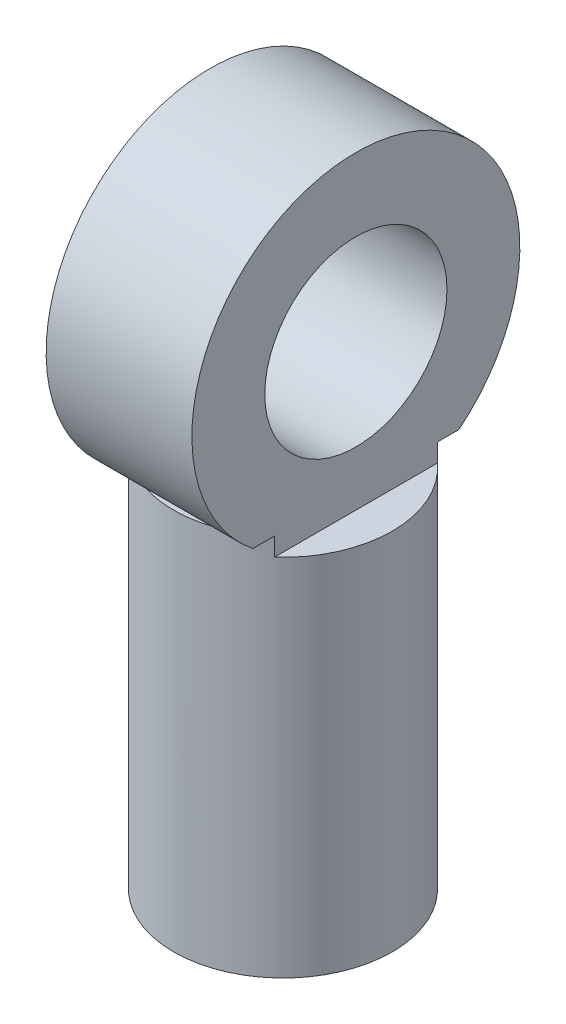
ISO-10303-21;
HEADER;
FILE_DESCRIPTION(('STEP AP214'),'2;1');
FILE_NAME('part.step','',(''),(''),'','','');
FILE_SCHEMA(('AUTOMOTIVE_DESIGN { 1 0 10303 214 1 1 1 1 }'));
ENDSEC;
DATA;
#1=APPLICATION_CONTEXT('core data for automotive mechanical design processes');
#2=APPLICATION_PROTOCOL_DEFINITION('international standard','automotive_design',2000,#1);
#3=PRODUCT_CONTEXT('',#1,'mechanical');
#4=PRODUCT('Part','Part','',(#3));
#5=PRODUCT_RELATED_PRODUCT_CATEGORY('part','',(#4));
#6=PRODUCT_DEFINITION_FORMATION('','',#4);
#7=PRODUCT_DEFINITION_CONTEXT('part definition',#1,'design');
#8=PRODUCT_DEFINITION('design','',#6,#7);
#9=PRODUCT_DEFINITION_SHAPE('','',#8);
#10=(LENGTH_UNIT() NAMED_UNIT(*) SI_UNIT(.MILLI.,.METRE.));
#11=(NAMED_UNIT(*) PLANE_ANGLE_UNIT() SI_UNIT($,.RADIAN.));
#12=(NAMED_UNIT(*) SI_UNIT($,.STERADIAN.) SOLID_ANGLE_UNIT());
#13=UNCERTAINTY_MEASURE_WITH_UNIT(LENGTH_MEASURE(1.E-05),#10,'distance_accuracy_value','');
#14=(GEOMETRIC_REPRESENTATION_CONTEXT(3) GLOBAL_UNCERTAINTY_ASSIGNED_CONTEXT((#13)) GLOBAL_UNIT_ASSIGNED_CONTEXT((#10,
#11,#12)) REPRESENTATION_CONTEXT('',''));
#15=CARTESIAN_POINT('',(0.,0.,0.));
#16=DIRECTION('',(0.,0.,1.));
#17=DIRECTION('',(1.,0.,0.));
#18=AXIS2_PLACEMENT_3D('',#15,#16,#17);
#19=CARTESIAN_POINT('',(-2.,10.5,0.));
#20=DIRECTION('',(0.,-1.,0.));
#21=DIRECTION('',(0.,0.,-1.));
#22=AXIS2_PLACEMENT_3D('',#19,#20,#21);
#23=PLANE('',#22);
#24=DIRECTION('',(1.,0.,0.));
#25=VECTOR('',#24,1.);
#26=CARTESIAN_POINT('',(-2.,10.5,2.82842712474619));
#27=LINE('',#26,#25);
#28=CARTESIAN_POINT('',(-0.999999999999999,10.5,2.82842712474619));
#29=VERTEX_POINT('',#28);
#30=CARTESIAN_POINT('',(0.999999999999999,10.5,2.82842712474619));
#31=VERTEX_POINT('',#30);
#32=EDGE_CURVE('E186',#29,#31,#27,.T.);
#33=ORIENTED_EDGE('',*,*,#32,.F.);
#34=CARTESIAN_POINT('',(0.,10.5,0.));
#35=DIRECTION('',(0.,1.,0.));
#36=DIRECTION('',(0.,0.,1.));
#37=AXIS2_PLACEMENT_3D('',#34,#35,#36);
#38=CIRCLE('',#37,3.);
#39=EDGE_CURVE('E180',#29,#31,#38,.T.);
#40=ORIENTED_EDGE('',*,*,#39,.T.);
#41=EDGE_LOOP('',(#33,#40));
#42=FACE_BOUND('',#41,.T.);
#43=ADVANCED_FACE('F94',(#42),#23,.F.);
#44=CARTESIAN_POINT('',(2.,10.5,0.));
#45=DIRECTION('',(0.,1.,0.));
#46=DIRECTION('',(0.,0.,1.));
#47=AXIS2_PLACEMENT_3D('',#44,#45,#46);
#48=PLANE('',#47);
#49=CARTESIAN_POINT('',(0.999999999999992,10.5,-2.82842712474619));
#50=VERTEX_POINT('',#49);
#51=CARTESIAN_POINT('',(-0.999999999999992,10.5,-2.82842712474619));
#52=VERTEX_POINT('',#51);
#53=EDGE_CURVE('E459',#50,#52,#38,.T.);
#54=ORIENTED_EDGE('',*,*,#53,.T.);
#55=DIRECTION('',(1.,0.,0.));
#56=VECTOR('',#55,1.);
#57=CARTESIAN_POINT('',(-2.,10.5,-2.82842712474619));
#58=LINE('',#57,#56);
#59=EDGE_CURVE('E423',#52,#50,#58,.T.);
#60=ORIENTED_EDGE('',*,*,#59,.T.);
#61=EDGE_LOOP('',(#54,#60));
#62=FACE_BOUND('',#61,.T.);
#63=ADVANCED_FACE('F240',(#62),#48,.T.);
#64=CARTESIAN_POINT('',(0.,10.,0.));
#65=DIRECTION('',(0.,1.,0.));
#66=DIRECTION('',(0.,0.,1.));
#67=AXIS2_PLACEMENT_3D('',#64,#65,#66);
#68=PLANE('',#67);
#69=CARTESIAN_POINT('',(0.,10.,0.));
#70=DIRECTION('',(0.,1.,0.));
#71=DIRECTION('',(0.,0.,1.));
#72=AXIS2_PLACEMENT_3D('',#69,#70,#71);
#73=CIRCLE('',#72,3.);
#74=CARTESIAN_POINT('',(-2.,10.,-2.23606797749979));
#75=VERTEX_POINT('',#74);
#76=CARTESIAN_POINT('',(-2.,10.,2.23606797749979));
#77=VERTEX_POINT('',#76);
#78=EDGE_CURVE('E210',#75,#77,#73,.T.);
#79=ORIENTED_EDGE('',*,*,#78,.T.);
#80=DIRECTION('',(0.,0.,-1.));
#81=VECTOR('',#80,1.);
#82=CARTESIAN_POINT('',(-2.,10.,0.));
#83=LINE('',#82,#81);
#84=EDGE_CURVE('E13',#77,#75,#83,.T.);
#85=ORIENTED_EDGE('',*,*,#84,.T.);
#86=EDGE_LOOP('',(#79,#85));
#87=FACE_BOUND('',#86,.T.);
#88=ADVANCED_FACE('F237',(#87),#68,.T.);
#89=CARTESIAN_POINT('',(0.,10.,0.));
#90=DIRECTION('',(0.,-1.,0.));
#91=DIRECTION('',(0.,0.,-1.));
#92=AXIS2_PLACEMENT_3D('',#89,#90,#91);
#93=CYLINDRICAL_SURFACE('',#92,3.);
#94=CARTESIAN_POINT('',(2.,10.,2.23606797749979));
#95=VERTEX_POINT('',#94);
#96=CARTESIAN_POINT('',(2.,10.,-2.23606797749979));
#97=VERTEX_POINT('',#96);
#98=EDGE_CURVE('E213',#95,#97,#73,.T.);
#99=ORIENTED_EDGE('',*,*,#98,.F.);
#100=DIRECTION('',(0.,-1.,0.));
#101=VECTOR('',#100,1.);
#102=CARTESIAN_POINT('',(2.,10.5,2.23606797749979));
#103=LINE('',#102,#101);
#104=CARTESIAN_POINT('',(2.,10.5,2.23606797749979));
#105=VERTEX_POINT('',#104);
#106=EDGE_CURVE('E120',#95,#105,#103,.F.);
#107=ORIENTED_EDGE('',*,*,#106,.T.);
#108=EDGE_CURVE('E166',#31,#105,#38,.T.);
#109=ORIENTED_EDGE('',*,*,#108,.F.);
#110=ORIENTED_EDGE('',*,*,#39,.F.);
#111=CARTESIAN_POINT('',(-2.,10.5,2.23606797749979));
#112=VERTEX_POINT('',#111);
#113=EDGE_CURVE('E190',#112,#29,#38,.T.);
#114=ORIENTED_EDGE('',*,*,#113,.F.);
#115=DIRECTION('',(0.,-1.,0.));
#116=VECTOR('',#115,1.);
#117=CARTESIAN_POINT('',(-2.,10.5,2.23606797749979));
#118=LINE('',#117,#116);
#119=EDGE_CURVE('E189',#77,#112,#118,.F.);
#120=ORIENTED_EDGE('',*,*,#119,.F.);
#121=ORIENTED_EDGE('',*,*,#78,.F.);
#122=DIRECTION('',(0.,-1.,0.));
#123=VECTOR('',#122,1.);
#124=CARTESIAN_POINT('',(-2.,10.5,-2.23606797749979));
#125=LINE('',#124,#123);
#126=CARTESIAN_POINT('',(-2.,10.5,-2.23606797749979));
#127=VERTEX_POINT('',#126);
#128=EDGE_CURVE('E444',#127,#75,#125,.T.);
#129=ORIENTED_EDGE('',*,*,#128,.F.);
#130=EDGE_CURVE('E462',#52,#127,#38,.T.);
#131=ORIENTED_EDGE('',*,*,#130,.F.);
#132=ORIENTED_EDGE('',*,*,#53,.F.);
#133=CARTESIAN_POINT('',(2.,10.5,-2.23606797749979));
#134=VERTEX_POINT('',#133);
#135=EDGE_CURVE('E112',#134,#50,#38,.T.);
#136=ORIENTED_EDGE('',*,*,#135,.F.);
#137=DIRECTION('',(0.,-1.,0.));
#138=VECTOR('',#137,1.);
#139=CARTESIAN_POINT('',(2.,10.5,-2.23606797749979));
#140=LINE('',#139,#138);
#141=EDGE_CURVE('E453',#134,#97,#140,.T.);
#142=ORIENTED_EDGE('',*,*,#141,.T.);
#143=EDGE_LOOP('',(#99,#107,#109,#110,#114,#120,#121,#129,#131,#132,#136,#142));
#144=FACE_BOUND('',#143,.T.);
#145=CARTESIAN_POINT('',(0.,0.,0.));
#146=DIRECTION('',(0.,1.,0.));
#147=DIRECTION('',(0.,0.,1.));
#148=AXIS2_PLACEMENT_3D('',#145,#146,#147);
#149=CIRCLE('',#148,3.);
#150=CARTESIAN_POINT('',(0.,0.,3.));
#151=VERTEX_POINT('',#150);
#152=EDGE_CURVE('E98',#151,#151,#149,.T.);
#153=ORIENTED_EDGE('',*,*,#152,.T.);
#154=EDGE_LOOP('',(#153));
#155=FACE_BOUND('',#154,.T.);
#156=ADVANCED_FACE('F96',(#144,#155),#93,.T.);
#157=DIRECTION('',(0.,0.,-1.));
#158=VECTOR('',#157,1.);
#159=CARTESIAN_POINT('',(2.,10.,0.));
#160=LINE('',#159,#158);
#161=EDGE_CURVE('E104',#95,#97,#160,.T.);
#162=ORIENTED_EDGE('',*,*,#161,.F.);
#163=ORIENTED_EDGE('',*,*,#98,.T.);
#164=EDGE_LOOP('',(#162,#163));
#165=FACE_BOUND('',#164,.T.);
#166=ADVANCED_FACE('F226',(#165),#68,.T.);
#167=CARTESIAN_POINT('',(0.,0.,0.));
#168=DIRECTION('',(0.,1.,0.));
#169=DIRECTION('',(0.,0.,1.));
#170=AXIS2_PLACEMENT_3D('',#167,#168,#169);
#171=PLANE('',#170);
#172=CARTESIAN_POINT('',(0.,0.,0.));
#173=DIRECTION('',(0.,-1.,0.));
#174=DIRECTION('',(0.,0.,-1.));
#175=AXIS2_PLACEMENT_3D('',#172,#173,#174);
#176=CIRCLE('',#175,1.65);
#177=CARTESIAN_POINT('',(0.,0.,-1.65));
#178=VERTEX_POINT('',#177);
#179=EDGE_CURVE('E200',#178,#178,#176,.T.);
#180=ORIENTED_EDGE('',*,*,#179,.F.);
#181=EDGE_LOOP('',(#180));
#182=FACE_BOUND('',#181,.T.);
#183=ORIENTED_EDGE('',*,*,#152,.F.);
#184=EDGE_LOOP('',(#183));
#185=FACE_BOUND('',#184,.T.);
#186=ADVANCED_FACE('F223',(#182,#185),#171,.F.);
#187=CARTESIAN_POINT('',(0.,9.,0.));
#188=DIRECTION('',(0.,-1.,0.));
#189=DIRECTION('',(0.,0.,-1.));
#190=AXIS2_PLACEMENT_3D('',#187,#188,#189);
#191=CYLINDRICAL_SURFACE('',#190,1.65);
#192=CARTESIAN_POINT('',(0.,9.,0.));
#193=DIRECTION('',(0.,-1.,0.));
#194=DIRECTION('',(0.,0.,-1.));
#195=AXIS2_PLACEMENT_3D('',#192,#193,#194);
#196=CIRCLE('',#195,1.65);
#197=CARTESIAN_POINT('',(0.,9.,-1.65));
#198=VERTEX_POINT('',#197);
#199=EDGE_CURVE('E204',#198,#198,#196,.T.);
#200=ORIENTED_EDGE('',*,*,#199,.F.);
#201=EDGE_LOOP('',(#200));
#202=FACE_BOUND('',#201,.T.);
#203=ORIENTED_EDGE('',*,*,#179,.T.);
#204=EDGE_LOOP('',(#203));
#205=FACE_BOUND('',#204,.T.);
#206=ADVANCED_FACE('F225',(#202,#205),#191,.F.);
#207=CARTESIAN_POINT('',(0.,9.,0.));
#208=DIRECTION('',(0.,-1.,0.));
#209=DIRECTION('',(0.,0.,-1.));
#210=AXIS2_PLACEMENT_3D('',#207,#208,#209);
#211=PLANE('',#210);
#212=ORIENTED_EDGE('',*,*,#199,.T.);
#213=EDGE_LOOP('',(#212));
#214=FACE_BOUND('',#213,.T.);
#215=ADVANCED_FACE('F232',(#214),#211,.T.);
#216=CARTESIAN_POINT('',(-2.,14.,0.));
#217=DIRECTION('',(1.,0.,0.));
#218=DIRECTION('',(0.,0.,-1.));
#219=AXIS2_PLACEMENT_3D('',#216,#217,#218);
#220=CYLINDRICAL_SURFACE('',#219,4.5);
#221=CARTESIAN_POINT('',(-2.,10.5,-2.82842712474619));
#222=VERTEX_POINT('',#221);
#223=EDGE_CURVE('E201',#222,#52,#58,.T.);
#224=ORIENTED_EDGE('',*,*,#223,.F.);
#225=CARTESIAN_POINT('',(-2.,14.,0.));
#226=DIRECTION('',(1.,0.,0.));
#227=DIRECTION('',(0.,0.,-1.));
#228=AXIS2_PLACEMENT_3D('',#225,#226,#227);
#229=CIRCLE('',#228,4.5);
#230=CARTESIAN_POINT('',(-2.,10.5,2.82842712474619));
#231=VERTEX_POINT('',#230);
#232=EDGE_CURVE('E196',#222,#231,#229,.T.);
#233=ORIENTED_EDGE('',*,*,#232,.T.);
#234=EDGE_CURVE('E194',#231,#29,#27,.T.);
#235=ORIENTED_EDGE('',*,*,#234,.T.);
#236=ORIENTED_EDGE('',*,*,#32,.T.);
#237=DIRECTION('',(1.,0.,0.));
#238=VECTOR('',#237,1.);
#239=CARTESIAN_POINT('',(-2.,10.5,2.82842712474619));
#240=LINE('',#239,#238);
#241=CARTESIAN_POINT('',(2.,10.5,2.82842712474619));
#242=VERTEX_POINT('',#241);
#243=EDGE_CURVE('E163',#242,#31,#240,.F.);
#244=ORIENTED_EDGE('',*,*,#243,.F.);
#245=CARTESIAN_POINT('',(2.,14.,0.));
#246=DIRECTION('',(1.,0.,0.));
#247=DIRECTION('',(0.,0.,-1.));
#248=AXIS2_PLACEMENT_3D('',#245,#246,#247);
#249=CIRCLE('',#248,4.5);
#250=CARTESIAN_POINT('',(2.,10.5,-2.82842712474619));
#251=VERTEX_POINT('',#250);
#252=EDGE_CURVE('E429',#251,#242,#249,.T.);
#253=ORIENTED_EDGE('',*,*,#252,.F.);
#254=DIRECTION('',(1.,0.,0.));
#255=VECTOR('',#254,1.);
#256=CARTESIAN_POINT('',(-2.,10.5,-2.82842712474619));
#257=LINE('',#256,#255);
#258=EDGE_CURVE('E442',#50,#251,#257,.T.);
#259=ORIENTED_EDGE('',*,*,#258,.F.);
#260=ORIENTED_EDGE('',*,*,#59,.F.);
#261=EDGE_LOOP('',(#224,#233,#235,#236,#244,#253,#259,#260));
#262=FACE_BOUND('',#261,.T.);
#263=ADVANCED_FACE('F192',(#262),#220,.T.);
#264=CARTESIAN_POINT('',(-2.,0.,0.));
#265=DIRECTION('',(1.,0.,0.));
#266=DIRECTION('',(0.,0.,-1.));
#267=AXIS2_PLACEMENT_3D('',#264,#265,#266);
#268=PLANE('',#267);
#269=CARTESIAN_POINT('',(-2.,14.,0.));
#270=DIRECTION('',(1.,0.,0.));
#271=DIRECTION('',(0.,0.,-1.));
#272=AXIS2_PLACEMENT_3D('',#269,#270,#271);
#273=CIRCLE('',#272,2.5);
#274=CARTESIAN_POINT('',(-2.,14.,-2.5));
#275=VERTEX_POINT('',#274);
#276=EDGE_CURVE('E433',#275,#275,#273,.T.);
#277=ORIENTED_EDGE('',*,*,#276,.T.);
#278=EDGE_LOOP('',(#277));
#279=FACE_BOUND('',#278,.T.);
#280=ORIENTED_EDGE('',*,*,#119,.T.);
#281=DIRECTION('',(0.,0.,1.));
#282=VECTOR('',#281,1.);
#283=CARTESIAN_POINT('',(-2.,10.5,0.));
#284=LINE('',#283,#282);
#285=EDGE_CURVE('E412',#112,#231,#284,.T.);
#286=ORIENTED_EDGE('',*,*,#285,.T.);
#287=ORIENTED_EDGE('',*,*,#232,.F.);
#288=EDGE_CURVE('E174',#222,#127,#284,.T.);
#289=ORIENTED_EDGE('',*,*,#288,.T.);
#290=ORIENTED_EDGE('',*,*,#128,.T.);
#291=ORIENTED_EDGE('',*,*,#84,.F.);
#292=EDGE_LOOP('',(#280,#286,#287,#289,#290,#291));
#293=FACE_BOUND('',#292,.T.);
#294=ADVANCED_FACE('F249',(#279,#293),#268,.F.);
#295=CARTESIAN_POINT('',(2.,0.,0.));
#296=DIRECTION('',(1.,0.,0.));
#297=DIRECTION('',(0.,0.,-1.));
#298=AXIS2_PLACEMENT_3D('',#295,#296,#297);
#299=PLANE('',#298);
#300=DIRECTION('',(0.,0.,1.));
#301=VECTOR('',#300,1.);
#302=CARTESIAN_POINT('',(2.,10.5,0.));
#303=LINE('',#302,#301);
#304=EDGE_CURVE('E167',#105,#242,#303,.T.);
#305=ORIENTED_EDGE('',*,*,#304,.F.);
#306=ORIENTED_EDGE('',*,*,#106,.F.);
#307=ORIENTED_EDGE('',*,*,#161,.T.);
#308=ORIENTED_EDGE('',*,*,#141,.F.);
#309=EDGE_CURVE('E418',#251,#134,#303,.T.);
#310=ORIENTED_EDGE('',*,*,#309,.F.);
#311=ORIENTED_EDGE('',*,*,#252,.T.);
#312=EDGE_LOOP('',(#305,#306,#307,#308,#310,#311));
#313=FACE_BOUND('',#312,.T.);
#314=CARTESIAN_POINT('',(2.,14.,0.));
#315=DIRECTION('',(1.,0.,0.));
#316=DIRECTION('',(0.,0.,-1.));
#317=AXIS2_PLACEMENT_3D('',#314,#315,#316);
#318=CIRCLE('',#317,2.5);
#319=CARTESIAN_POINT('',(2.,14.,-2.5));
#320=VERTEX_POINT('',#319);
#321=EDGE_CURVE('E173',#320,#320,#318,.T.);
#322=ORIENTED_EDGE('',*,*,#321,.F.);
#323=EDGE_LOOP('',(#322));
#324=FACE_BOUND('',#323,.T.);
#325=ADVANCED_FACE('F272',(#313,#324),#299,.T.);
#326=CARTESIAN_POINT('',(-3.,14.,0.));
#327=DIRECTION('',(1.,0.,0.));
#328=DIRECTION('',(0.,0.,-1.));
#329=AXIS2_PLACEMENT_3D('',#326,#327,#328);
#330=CYLINDRICAL_SURFACE('',#329,2.5);
#331=ORIENTED_EDGE('',*,*,#321,.T.);
#332=EDGE_LOOP('',(#331));
#333=FACE_BOUND('',#332,.T.);
#334=ORIENTED_EDGE('',*,*,#276,.F.);
#335=EDGE_LOOP('',(#334));
#336=FACE_BOUND('',#335,.T.);
#337=ADVANCED_FACE('F279',(#333,#336),#330,.F.);
#338=CARTESIAN_POINT('',(0.,10.5,0.));
#339=DIRECTION('',(0.,1.,0.));
#340=DIRECTION('',(0.,0.,1.));
#341=AXIS2_PLACEMENT_3D('',#338,#339,#340);
#342=PLANE('',#341);
#343=ORIENTED_EDGE('',*,*,#309,.T.);
#344=ORIENTED_EDGE('',*,*,#135,.T.);
#345=ORIENTED_EDGE('',*,*,#258,.T.);
#346=EDGE_LOOP('',(#343,#344,#345));
#347=FACE_BOUND('',#346,.T.);
#348=ADVANCED_FACE('F286',(#347),#342,.F.);
#349=ORIENTED_EDGE('',*,*,#223,.T.);
#350=ORIENTED_EDGE('',*,*,#130,.T.);
#351=ORIENTED_EDGE('',*,*,#288,.F.);
#352=EDGE_LOOP('',(#349,#350,#351));
#353=FACE_BOUND('',#352,.T.);
#354=ADVANCED_FACE('F293',(#353),#342,.F.);
#355=ORIENTED_EDGE('',*,*,#234,.F.);
#356=ORIENTED_EDGE('',*,*,#285,.F.);
#357=ORIENTED_EDGE('',*,*,#113,.T.);
#358=EDGE_LOOP('',(#355,#356,#357));
#359=FACE_BOUND('',#358,.T.);
#360=ADVANCED_FACE('F301',(#359),#342,.F.);
#361=ORIENTED_EDGE('',*,*,#243,.T.);
#362=ORIENTED_EDGE('',*,*,#108,.T.);
#363=ORIENTED_EDGE('',*,*,#304,.T.);
#364=EDGE_LOOP('',(#361,#362,#363));
#365=FACE_BOUND('',#364,.T.);
#366=ADVANCED_FACE('F165',(#365),#342,.F.);
#367=CLOSED_SHELL('',(#43,#63,#88,#156,#166,#186,#206,#215,#263,#294,#325,#337,#348,#354,#360,#366));
#368=MANIFOLD_SOLID_BREP('B2',#367);
#369=ADVANCED_BREP_SHAPE_REPRESENTATION('',(#18,#368),#14);
#370=SHAPE_DEFINITION_REPRESENTATION(#9,#369);
ENDSEC;
END-ISO-10303-21;
